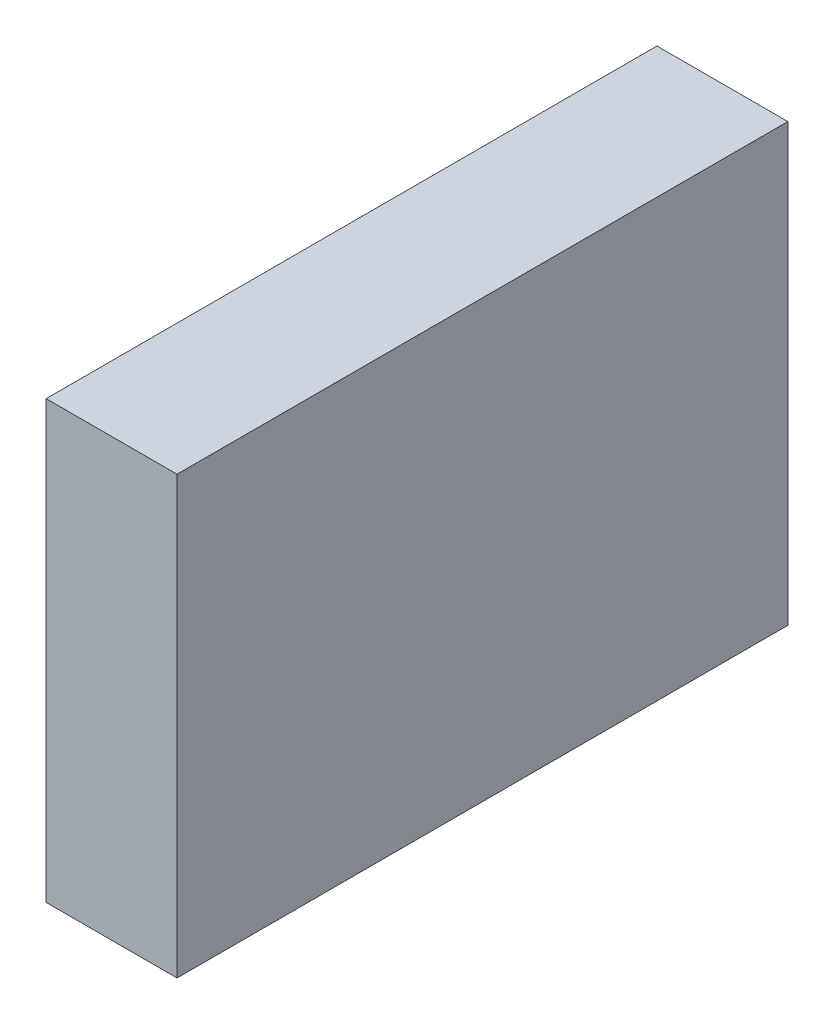
ISO-10303-21;
HEADER;
FILE_DESCRIPTION(('STEP AP214'),'2;1');
FILE_NAME('part.step','',(''),(''),'','','');
FILE_SCHEMA(('AUTOMOTIVE_DESIGN { 1 0 10303 214 1 1 1 1 }'));
ENDSEC;
DATA;
#1=APPLICATION_CONTEXT('core data for automotive mechanical design processes');
#2=APPLICATION_PROTOCOL_DEFINITION('international standard','automotive_design',2000,#1);
#3=PRODUCT_CONTEXT('',#1,'mechanical');
#4=PRODUCT('Part','Part','',(#3));
#5=PRODUCT_RELATED_PRODUCT_CATEGORY('part','',(#4));
#6=PRODUCT_DEFINITION_FORMATION('','',#4);
#7=PRODUCT_DEFINITION_CONTEXT('part definition',#1,'design');
#8=PRODUCT_DEFINITION('design','',#6,#7);
#9=PRODUCT_DEFINITION_SHAPE('','',#8);
#10=(LENGTH_UNIT() NAMED_UNIT(*) SI_UNIT(.MILLI.,.METRE.));
#11=(NAMED_UNIT(*) PLANE_ANGLE_UNIT() SI_UNIT($,.RADIAN.));
#12=(NAMED_UNIT(*) SI_UNIT($,.STERADIAN.) SOLID_ANGLE_UNIT());
#13=UNCERTAINTY_MEASURE_WITH_UNIT(LENGTH_MEASURE(1.E-05),#10,'distance_accuracy_value','');
#14=(GEOMETRIC_REPRESENTATION_CONTEXT(3) GLOBAL_UNCERTAINTY_ASSIGNED_CONTEXT((#13)) GLOBAL_UNIT_ASSIGNED_CONTEXT((#10,
#11,#12)) REPRESENTATION_CONTEXT('',''));
#15=CARTESIAN_POINT('',(0.,0.,0.));
#16=DIRECTION('',(0.,0.,1.));
#17=DIRECTION('',(1.,0.,0.));
#18=AXIS2_PLACEMENT_3D('',#15,#16,#17);
#19=CARTESIAN_POINT('',(-3.00000031821894,-1.81999965293158,-3.72112168010555));
#20=DIRECTION('',(1.,-1.74845553146952E-07,0.));
#21=DIRECTION('',(1.74845553146952E-07,1.,8.74227765734759E-08));
#22=AXIS2_PLACEMENT_3D('',#19,#20,#21);
#23=PLANE('',#22);
#24=DIRECTION('',(0.,-8.74227765576152E-08,0.999999999999996));
#25=VECTOR('',#24,1.);
#26=CARTESIAN_POINT('',(-3.0000001311342,-0.749999659049171,-3.65112158656318));
#27=LINE('',#26,#25);
#28=CARTESIAN_POINT('',(-3.0000001311342,-0.749999659049171,-3.65112158656218));
#29=VERTEX_POINT('',#28);
#30=CARTESIAN_POINT('',(-3.00000013113422,-0.749999781442059,-2.25112158656318));
#31=VERTEX_POINT('',#30);
#32=EDGE_CURVE('E11',#29,#31,#27,.T.);
#33=ORIENTED_EDGE('',*,*,#32,.T.);
#34=DIRECTION('',(-1.74845553146599E-07,-0.999999999999981,-8.74227765732994E-08));
#35=VECTOR('',#34,1.);
#36=CARTESIAN_POINT('',(-3.00000013113422,-0.749999781441059,-2.25112158656318));
#37=LINE('',#36,#35);
#38=CARTESIAN_POINT('',(-3.00000030597977,-1.74999978144306,-2.25112167398695));
#39=VERTEX_POINT('',#38);
#40=EDGE_CURVE('E69',#31,#39,#37,.T.);
#41=ORIENTED_EDGE('',*,*,#40,.T.);
#42=DIRECTION('',(0.,8.74227764783136E-08,-0.999999999999996));
#43=VECTOR('',#42,1.);
#44=CARTESIAN_POINT('',(-3.00000030597977,-1.74999978144306,-2.25112167398595));
#45=LINE('',#44,#43);
#46=CARTESIAN_POINT('',(-3.00000030597975,-1.74999965905017,-3.65112167398595));
#47=VERTEX_POINT('',#46);
#48=EDGE_CURVE('E55',#39,#47,#45,.T.);
#49=ORIENTED_EDGE('',*,*,#48,.T.);
#50=DIRECTION('',(1.74845553146599E-07,0.999999999999981,8.74227765732993E-08));
#51=VECTOR('',#50,1.);
#52=CARTESIAN_POINT('',(-3.00000030597975,-1.74999965905117,-3.65112167398595));
#53=LINE('',#52,#51);
#54=EDGE_CURVE('E53',#47,#29,#53,.T.);
#55=ORIENTED_EDGE('',*,*,#54,.T.);
#56=EDGE_LOOP('',(#33,#41,#49,#55));
#57=FACE_BOUND('',#56,.T.);
#58=ADVANCED_FACE('F17',(#57),#23,.T.);
#59=CARTESIAN_POINT('',(-3.30000031821894,-1.81999960047791,-3.72112168010555));
#60=DIRECTION('',(1.,-1.74845553146952E-07,0.));
#61=DIRECTION('',(1.74845553146952E-07,1.,8.74227765734759E-08));
#62=AXIS2_PLACEMENT_3D('',#59,#60,#61);
#63=PLANE('',#62);
#64=DIRECTION('',(1.74845553146599E-07,0.999999999999981,8.74227765732993E-08));
#65=VECTOR('',#64,1.);
#66=CARTESIAN_POINT('',(-3.30000030597975,-1.74999960659751,-3.65112167398595));
#67=LINE('',#66,#65);
#68=CARTESIAN_POINT('',(-3.30000030597975,-1.74999960659651,-3.65112167398595));
#69=VERTEX_POINT('',#68);
#70=CARTESIAN_POINT('',(-3.3000001311342,-0.749999606595505,-3.65112158656218));
#71=VERTEX_POINT('',#70);
#72=EDGE_CURVE('E24',#69,#71,#67,.T.);
#73=ORIENTED_EDGE('',*,*,#72,.F.);
#74=DIRECTION('',(0.,8.74227766369168E-08,-0.999999999999996));
#75=VECTOR('',#74,1.);
#76=CARTESIAN_POINT('',(-3.30000030597977,-1.74999972898939,-2.25112167398595));
#77=LINE('',#76,#75);
#78=CARTESIAN_POINT('',(-3.30000030597977,-1.74999972898939,-2.25112167398695));
#79=VERTEX_POINT('',#78);
#80=EDGE_CURVE('E70',#79,#69,#77,.T.);
#81=ORIENTED_EDGE('',*,*,#80,.F.);
#82=DIRECTION('',(-1.74845553146599E-07,-0.999999999999981,-8.74227765732993E-08));
#83=VECTOR('',#82,1.);
#84=CARTESIAN_POINT('',(-3.30000013113422,-0.749999728987393,-2.25112158656318));
#85=LINE('',#84,#83);
#86=CARTESIAN_POINT('',(-3.30000013113422,-0.749999728988393,-2.25112158656318));
#87=VERTEX_POINT('',#86);
#88=EDGE_CURVE('E59',#87,#79,#85,.T.);
#89=ORIENTED_EDGE('',*,*,#88,.F.);
#90=DIRECTION('',(0.,-8.74227765576152E-08,0.999999999999996));
#91=VECTOR('',#90,1.);
#92=CARTESIAN_POINT('',(-3.3000001311342,-0.749999606595505,-3.65112158656318));
#93=LINE('',#92,#91);
#94=EDGE_CURVE('E78',#71,#87,#93,.T.);
#95=ORIENTED_EDGE('',*,*,#94,.F.);
#96=EDGE_LOOP('',(#73,#81,#89,#95));
#97=FACE_BOUND('',#96,.T.);
#98=ADVANCED_FACE('F89',(#97),#63,.F.);
#99=CARTESIAN_POINT('',(-3.0000001311342,-0.749999659049171,-3.65112158656318));
#100=DIRECTION('',(-1.74845553146952E-07,-1.,-8.74227765734759E-08));
#101=DIRECTION('',(0.,-8.74227765734759E-08,1.));
#102=AXIS2_PLACEMENT_3D('',#99,#100,#101);
#103=PLANE('',#102);
#104=DIRECTION('',(-0.999999999999985,1.74845553220964E-07,0.));
#105=VECTOR('',#104,1.);
#106=CARTESIAN_POINT('',(-3.0000001311342,-0.749999659049171,-3.65112158656318));
#107=LINE('',#106,#105);
#108=EDGE_CURVE('E65',#29,#71,#107,.T.);
#109=ORIENTED_EDGE('',*,*,#108,.T.);
#110=ORIENTED_EDGE('',*,*,#94,.T.);
#111=DIRECTION('',(-0.999999999999985,1.74845553220964E-07,0.));
#112=VECTOR('',#111,1.);
#113=CARTESIAN_POINT('',(-3.00000013113422,-0.749999781441059,-2.25112158656318));
#114=LINE('',#113,#112);
#115=EDGE_CURVE('E66',#31,#87,#114,.T.);
#116=ORIENTED_EDGE('',*,*,#115,.F.);
#117=ORIENTED_EDGE('',*,*,#32,.F.);
#118=EDGE_LOOP('',(#109,#110,#116,#117));
#119=FACE_BOUND('',#118,.T.);
#120=ADVANCED_FACE('F63',(#119),#103,.F.);
#121=CARTESIAN_POINT('',(-3.00000013113422,-0.749999781441059,-2.25112158656318));
#122=DIRECTION('',(0.,8.74227765734759E-08,-1.));
#123=DIRECTION('',(-1.74845553146952E-07,-1.,-8.74227765734759E-08));
#124=AXIS2_PLACEMENT_3D('',#121,#122,#123);
#125=PLANE('',#124);
#126=ORIENTED_EDGE('',*,*,#115,.T.);
#127=ORIENTED_EDGE('',*,*,#88,.T.);
#128=DIRECTION('',(-0.999999999999985,1.7484555285089E-07,0.));
#129=VECTOR('',#128,1.);
#130=CARTESIAN_POINT('',(-3.00000030597977,-1.74999978144306,-2.25112167398595));
#131=LINE('',#130,#129);
#132=EDGE_CURVE('E60',#39,#79,#131,.T.);
#133=ORIENTED_EDGE('',*,*,#132,.F.);
#134=ORIENTED_EDGE('',*,*,#40,.F.);
#135=EDGE_LOOP('',(#126,#127,#133,#134));
#136=FACE_BOUND('',#135,.T.);
#137=ADVANCED_FACE('F91',(#136),#125,.F.);
#138=CARTESIAN_POINT('',(-3.00000030597977,-1.74999978144306,-2.25112167398595));
#139=DIRECTION('',(1.74845553146952E-07,1.,8.74227765734759E-08));
#140=DIRECTION('',(0.,8.74227765734759E-08,-1.));
#141=AXIS2_PLACEMENT_3D('',#138,#139,#140);
#142=PLANE('',#141);
#143=ORIENTED_EDGE('',*,*,#132,.T.);
#144=ORIENTED_EDGE('',*,*,#80,.T.);
#145=DIRECTION('',(-0.999999999999985,1.7484555285089E-07,0.));
#146=VECTOR('',#145,1.);
#147=CARTESIAN_POINT('',(-3.00000030597975,-1.74999965905117,-3.65112167398595));
#148=LINE('',#147,#146);
#149=EDGE_CURVE('E84',#47,#69,#148,.T.);
#150=ORIENTED_EDGE('',*,*,#149,.F.);
#151=ORIENTED_EDGE('',*,*,#48,.F.);
#152=EDGE_LOOP('',(#143,#144,#150,#151));
#153=FACE_BOUND('',#152,.T.);
#154=ADVANCED_FACE('F86',(#153),#142,.F.);
#155=CARTESIAN_POINT('',(-3.00000030597975,-1.74999965905117,-3.65112167398595));
#156=DIRECTION('',(0.,-8.74227765734759E-08,1.));
#157=DIRECTION('',(1.74845553146952E-07,1.,8.74227765734759E-08));
#158=AXIS2_PLACEMENT_3D('',#155,#156,#157);
#159=PLANE('',#158);
#160=ORIENTED_EDGE('',*,*,#149,.T.);
#161=ORIENTED_EDGE('',*,*,#72,.T.);
#162=ORIENTED_EDGE('',*,*,#108,.F.);
#163=ORIENTED_EDGE('',*,*,#54,.F.);
#164=EDGE_LOOP('',(#160,#161,#162,#163));
#165=FACE_BOUND('',#164,.T.);
#166=ADVANCED_FACE('F68',(#165),#159,.F.);
#167=CLOSED_SHELL('',(#58,#98,#120,#137,#154,#166));
#168=MANIFOLD_SOLID_BREP('B1',#167);
#169=ADVANCED_BREP_SHAPE_REPRESENTATION('',(#18,#168),#14);
#170=SHAPE_DEFINITION_REPRESENTATION(#9,#169);
ENDSEC;
END-ISO-10303-21;
